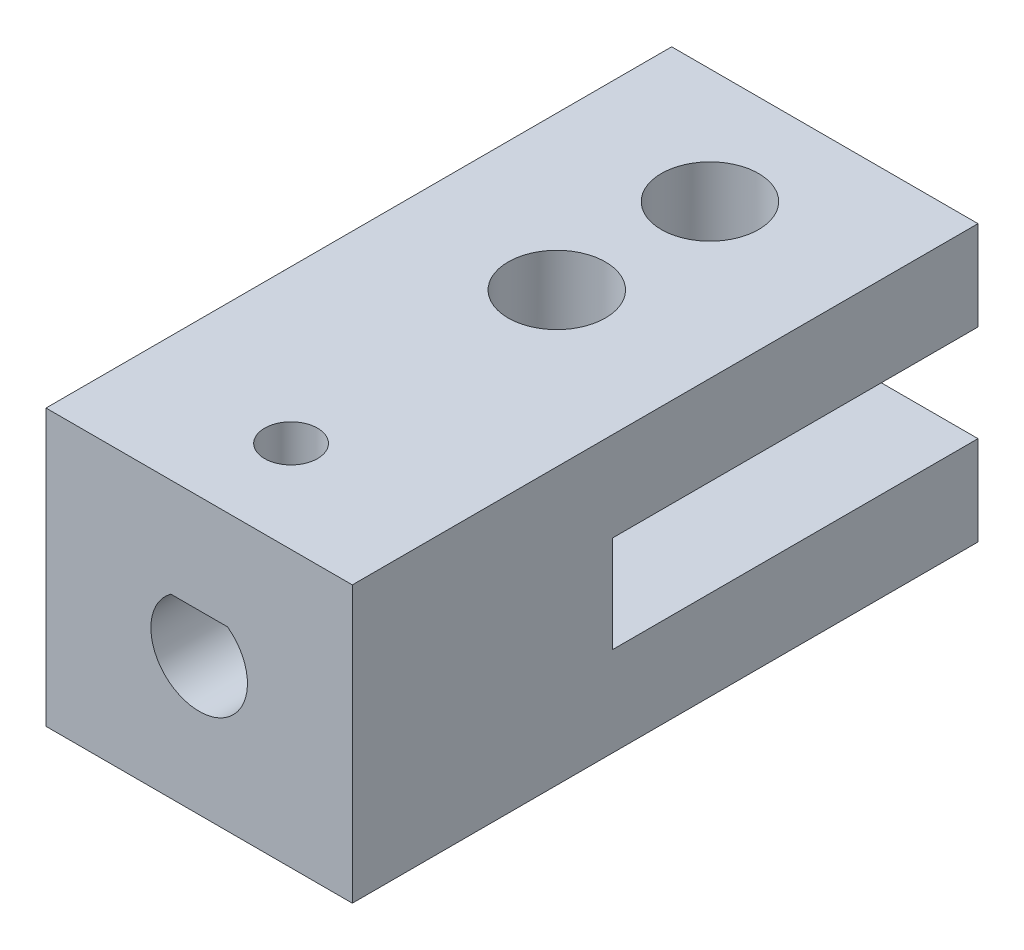
ISO-10303-21;
HEADER;
FILE_DESCRIPTION(('STEP AP214'),'2;1');
FILE_NAME('part.step','',(''),(''),'','','');
FILE_SCHEMA(('AUTOMOTIVE_DESIGN { 1 0 10303 214 1 1 1 1 }'));
ENDSEC;
DATA;
#1=APPLICATION_CONTEXT('core data for automotive mechanical design processes');
#2=APPLICATION_PROTOCOL_DEFINITION('international standard','automotive_design',2000,#1);
#3=PRODUCT_CONTEXT('',#1,'mechanical');
#4=PRODUCT('Part','Part','',(#3));
#5=PRODUCT_RELATED_PRODUCT_CATEGORY('part','',(#4));
#6=PRODUCT_DEFINITION_FORMATION('','',#4);
#7=PRODUCT_DEFINITION_CONTEXT('part definition',#1,'design');
#8=PRODUCT_DEFINITION('design','',#6,#7);
#9=PRODUCT_DEFINITION_SHAPE('','',#8);
#10=(LENGTH_UNIT() NAMED_UNIT(*) SI_UNIT(.MILLI.,.METRE.));
#11=(NAMED_UNIT(*) PLANE_ANGLE_UNIT() SI_UNIT($,.RADIAN.));
#12=(NAMED_UNIT(*) SI_UNIT($,.STERADIAN.) SOLID_ANGLE_UNIT());
#13=UNCERTAINTY_MEASURE_WITH_UNIT(LENGTH_MEASURE(1.E-05),#10,'distance_accuracy_value','');
#14=(GEOMETRIC_REPRESENTATION_CONTEXT(3) GLOBAL_UNCERTAINTY_ASSIGNED_CONTEXT((#13)) GLOBAL_UNIT_ASSIGNED_CONTEXT((#10,
#11,#12)) REPRESENTATION_CONTEXT('',''));
#15=CARTESIAN_POINT('',(0.,0.,0.));
#16=DIRECTION('',(0.,0.,1.));
#17=DIRECTION('',(1.,0.,0.));
#18=AXIS2_PLACEMENT_3D('',#15,#16,#17);
#19=CARTESIAN_POINT('',(-10.,-15.875,73.9879559526874));
#20=DIRECTION('',(-1.,0.,0.));
#21=DIRECTION('',(0.,0.,1.));
#22=AXIS2_PLACEMENT_3D('',#19,#20,#21);
#23=PLANE('',#22);
#24=DIRECTION('',(0.,1.,0.));
#25=VECTOR('',#24,1.);
#26=CARTESIAN_POINT('',(-10.,-15.875,73.9879559526874));
#27=LINE('',#26,#25);
#28=CARTESIAN_POINT('',(-10.,-3.7184,73.9879559526874));
#29=VERTEX_POINT('',#28);
#30=CARTESIAN_POINT('',(-10.,2.12499999999999,73.9879559526874));
#31=VERTEX_POINT('',#30);
#32=EDGE_CURVE('E49',#29,#31,#27,.T.);
#33=ORIENTED_EDGE('',*,*,#32,.F.);
#34=DIRECTION('',(0.,0.,1.));
#35=VECTOR('',#34,1.);
#36=CARTESIAN_POINT('',(-10.,-3.7184,73.9879559526874));
#37=LINE('',#36,#35);
#38=CARTESIAN_POINT('',(-10.,-3.7184,97.8379559526874));
#39=VERTEX_POINT('',#38);
#40=EDGE_CURVE('E106',#29,#39,#37,.T.);
#41=ORIENTED_EDGE('',*,*,#40,.T.);
#42=DIRECTION('',(0.,1.,0.));
#43=VECTOR('',#42,1.);
#44=CARTESIAN_POINT('',(-10.,-9.93,97.8379559526874));
#45=LINE('',#44,#43);
#46=CARTESIAN_POINT('',(-9.99999999999999,-10.0316,97.8379559526874));
#47=VERTEX_POINT('',#46);
#48=EDGE_CURVE('E156',#47,#39,#45,.T.);
#49=ORIENTED_EDGE('',*,*,#48,.F.);
#50=DIRECTION('',(0.,0.,-1.));
#51=VECTOR('',#50,1.);
#52=CARTESIAN_POINT('',(-10.,-10.0316,73.9879559526874));
#53=LINE('',#52,#51);
#54=CARTESIAN_POINT('',(-10.,-10.0316,73.9879559526874));
#55=VERTEX_POINT('',#54);
#56=EDGE_CURVE('E166',#47,#55,#53,.T.);
#57=ORIENTED_EDGE('',*,*,#56,.T.);
#58=CARTESIAN_POINT('',(-10.,-15.875,73.9879559526874));
#59=VERTEX_POINT('',#58);
#60=EDGE_CURVE('E12',#59,#55,#27,.T.);
#61=ORIENTED_EDGE('',*,*,#60,.F.);
#62=DIRECTION('',(0.,0.,1.));
#63=VECTOR('',#62,1.);
#64=CARTESIAN_POINT('',(-10.,-15.875,73.9879559526874));
#65=LINE('',#64,#63);
#66=CARTESIAN_POINT('',(-9.99999999999999,-15.875,114.837955952687));
#67=VERTEX_POINT('',#66);
#68=EDGE_CURVE('E125',#59,#67,#65,.T.);
#69=ORIENTED_EDGE('',*,*,#68,.T.);
#70=DIRECTION('',(0.,1.,0.));
#71=VECTOR('',#70,1.);
#72=CARTESIAN_POINT('',(-9.99999999999999,-15.875,114.837955952687));
#73=LINE('',#72,#71);
#74=CARTESIAN_POINT('',(-9.99999999999999,2.12499999999999,114.837955952687));
#75=VERTEX_POINT('',#74);
#76=EDGE_CURVE('E112',#67,#75,#73,.T.);
#77=ORIENTED_EDGE('',*,*,#76,.T.);
#78=DIRECTION('',(0.,0.,1.));
#79=VECTOR('',#78,1.);
#80=CARTESIAN_POINT('',(-10.,2.12499999999999,73.9879559526874));
#81=LINE('',#80,#79);
#82=EDGE_CURVE('E132',#31,#75,#81,.T.);
#83=ORIENTED_EDGE('',*,*,#82,.F.);
#84=EDGE_LOOP('',(#33,#41,#49,#57,#61,#69,#77,#83));
#85=FACE_BOUND('',#84,.T.);
#86=ADVANCED_FACE('F36',(#85),#23,.T.);
#87=CARTESIAN_POINT('',(-10.,-15.875,73.9879559526874));
#88=DIRECTION('',(0.,0.,-1.));
#89=DIRECTION('',(-1.,0.,0.));
#90=AXIS2_PLACEMENT_3D('',#87,#88,#89);
#91=PLANE('',#90);
#92=ORIENTED_EDGE('',*,*,#60,.T.);
#93=DIRECTION('',(-1.,0.,0.));
#94=VECTOR('',#93,1.);
#95=CARTESIAN_POINT('',(10.1016,-10.0316,73.9879559526874));
#96=LINE('',#95,#94);
#97=CARTESIAN_POINT('',(10.,-10.0316,73.9879559526874));
#98=VERTEX_POINT('',#97);
#99=EDGE_CURVE('E181',#98,#55,#96,.T.);
#100=ORIENTED_EDGE('',*,*,#99,.F.);
#101=DIRECTION('',(0.,1.,0.));
#102=VECTOR('',#101,1.);
#103=CARTESIAN_POINT('',(10.,-15.875,73.9879559526874));
#104=LINE('',#103,#102);
#105=CARTESIAN_POINT('',(10.,-15.875,73.9879559526874));
#106=VERTEX_POINT('',#105);
#107=EDGE_CURVE('E119',#106,#98,#104,.T.);
#108=ORIENTED_EDGE('',*,*,#107,.F.);
#109=DIRECTION('',(-1.,0.,0.));
#110=VECTOR('',#109,1.);
#111=CARTESIAN_POINT('',(-10.,-15.875,73.9879559526874));
#112=LINE('',#111,#110);
#113=EDGE_CURVE('E115',#106,#59,#112,.T.);
#114=ORIENTED_EDGE('',*,*,#113,.T.);
#115=EDGE_LOOP('',(#92,#100,#108,#114));
#116=FACE_BOUND('',#115,.T.);
#117=ADVANCED_FACE('F220',(#116),#91,.T.);
#118=CARTESIAN_POINT('',(10.,-15.875,73.9879559526874));
#119=DIRECTION('',(1.,0.,0.));
#120=DIRECTION('',(0.,0.,-1.));
#121=AXIS2_PLACEMENT_3D('',#118,#119,#120);
#122=PLANE('',#121);
#123=ORIENTED_EDGE('',*,*,#107,.T.);
#124=DIRECTION('',(0.,0.,1.));
#125=VECTOR('',#124,1.);
#126=CARTESIAN_POINT('',(10.,-10.0316,73.9879559526874));
#127=LINE('',#126,#125);
#128=CARTESIAN_POINT('',(10.,-10.0316,97.8379559526874));
#129=VERTEX_POINT('',#128);
#130=EDGE_CURVE('E169',#98,#129,#127,.T.);
#131=ORIENTED_EDGE('',*,*,#130,.T.);
#132=DIRECTION('',(0.,1.,0.));
#133=VECTOR('',#132,1.);
#134=CARTESIAN_POINT('',(10.,-9.93,97.8379559526874));
#135=LINE('',#134,#133);
#136=CARTESIAN_POINT('',(10.,-3.7184,97.8379559526874));
#137=VERTEX_POINT('',#136);
#138=EDGE_CURVE('E94',#129,#137,#135,.T.);
#139=ORIENTED_EDGE('',*,*,#138,.T.);
#140=DIRECTION('',(0.,0.,-1.));
#141=VECTOR('',#140,1.);
#142=CARTESIAN_POINT('',(10.,-3.7184,73.9879559526874));
#143=LINE('',#142,#141);
#144=CARTESIAN_POINT('',(10.,-3.7184,73.9879559526874));
#145=VERTEX_POINT('',#144);
#146=EDGE_CURVE('E176',#137,#145,#143,.T.);
#147=ORIENTED_EDGE('',*,*,#146,.T.);
#148=CARTESIAN_POINT('',(10.,2.12499999999999,73.9879559526874));
#149=VERTEX_POINT('',#148);
#150=EDGE_CURVE('E118',#145,#149,#104,.T.);
#151=ORIENTED_EDGE('',*,*,#150,.T.);
#152=DIRECTION('',(0.,0.,-1.));
#153=VECTOR('',#152,1.);
#154=CARTESIAN_POINT('',(10.,2.12499999999999,73.9879559526874));
#155=LINE('',#154,#153);
#156=CARTESIAN_POINT('',(9.99999999999999,2.12499999999999,114.837955952687));
#157=VERTEX_POINT('',#156);
#158=EDGE_CURVE('E126',#157,#149,#155,.T.);
#159=ORIENTED_EDGE('',*,*,#158,.F.);
#160=DIRECTION('',(0.,1.,0.));
#161=VECTOR('',#160,1.);
#162=CARTESIAN_POINT('',(9.99999999999999,-15.875,114.837955952687));
#163=LINE('',#162,#161);
#164=CARTESIAN_POINT('',(9.99999999999999,-15.875,114.837955952687));
#165=VERTEX_POINT('',#164);
#166=EDGE_CURVE('E114',#165,#157,#163,.T.);
#167=ORIENTED_EDGE('',*,*,#166,.F.);
#168=DIRECTION('',(0.,0.,-1.));
#169=VECTOR('',#168,1.);
#170=CARTESIAN_POINT('',(10.,-15.875,73.9879559526874));
#171=LINE('',#170,#169);
#172=EDGE_CURVE('E138',#165,#106,#171,.T.);
#173=ORIENTED_EDGE('',*,*,#172,.T.);
#174=EDGE_LOOP('',(#123,#131,#139,#147,#151,#159,#167,#173));
#175=FACE_BOUND('',#174,.T.);
#176=ADVANCED_FACE('F211',(#175),#122,.T.);
#177=CARTESIAN_POINT('',(0.,-15.875,91.4879559526874));
#178=DIRECTION('',(0.,1.,0.));
#179=DIRECTION('',(0.,0.,1.));
#180=AXIS2_PLACEMENT_3D('',#177,#178,#179);
#181=CYLINDRICAL_SURFACE('',#180,3.175);
#182=CARTESIAN_POINT('',(0.,-15.875,91.4879559526874));
#183=DIRECTION('',(0.,1.,0.));
#184=DIRECTION('',(0.,0.,1.));
#185=AXIS2_PLACEMENT_3D('',#182,#183,#184);
#186=CIRCLE('',#185,3.175);
#187=CARTESIAN_POINT('',(0.,-15.875,94.6629559526874));
#188=VERTEX_POINT('',#187);
#189=EDGE_CURVE('E135',#188,#188,#186,.T.);
#190=ORIENTED_EDGE('',*,*,#189,.F.);
#191=EDGE_LOOP('',(#190));
#192=FACE_BOUND('',#191,.T.);
#193=CARTESIAN_POINT('',(0.,-10.0316,91.4879559526874));
#194=DIRECTION('',(0.,1.,0.));
#195=DIRECTION('',(0.,0.,1.));
#196=AXIS2_PLACEMENT_3D('',#193,#194,#195);
#197=CIRCLE('',#196,3.175);
#198=CARTESIAN_POINT('',(0.,-10.0316,94.6629559526874));
#199=VERTEX_POINT('',#198);
#200=EDGE_CURVE('E105',#199,#199,#197,.F.);
#201=ORIENTED_EDGE('',*,*,#200,.F.);
#202=EDGE_LOOP('',(#201));
#203=FACE_BOUND('',#202,.T.);
#204=ADVANCED_FACE('F312',(#192,#203),#181,.F.);
#205=CARTESIAN_POINT('',(0.,-15.875,81.4879559526874));
#206=DIRECTION('',(0.,1.,0.));
#207=DIRECTION('',(0.,0.,1.));
#208=AXIS2_PLACEMENT_3D('',#205,#206,#207);
#209=CYLINDRICAL_SURFACE('',#208,3.175);
#210=CARTESIAN_POINT('',(0.,-15.875,81.4879559526874));
#211=DIRECTION('',(0.,1.,0.));
#212=DIRECTION('',(0.,0.,1.));
#213=AXIS2_PLACEMENT_3D('',#210,#211,#212);
#214=CIRCLE('',#213,3.175);
#215=CARTESIAN_POINT('',(0.,-15.875,84.6629559526874));
#216=VERTEX_POINT('',#215);
#217=EDGE_CURVE('E149',#216,#216,#214,.T.);
#218=ORIENTED_EDGE('',*,*,#217,.F.);
#219=EDGE_LOOP('',(#218));
#220=FACE_BOUND('',#219,.T.);
#221=CARTESIAN_POINT('',(0.,-10.0316,81.4879559526874));
#222=DIRECTION('',(0.,1.,0.));
#223=DIRECTION('',(0.,0.,1.));
#224=AXIS2_PLACEMENT_3D('',#221,#222,#223);
#225=CIRCLE('',#224,3.175);
#226=CARTESIAN_POINT('',(0.,-10.0316,84.6629559526874));
#227=VERTEX_POINT('',#226);
#228=EDGE_CURVE('E102',#227,#227,#225,.F.);
#229=ORIENTED_EDGE('',*,*,#228,.F.);
#230=EDGE_LOOP('',(#229));
#231=FACE_BOUND('',#230,.T.);
#232=ADVANCED_FACE('F272',(#220,#231),#209,.F.);
#233=ORIENTED_EDGE('',*,*,#150,.F.);
#234=DIRECTION('',(1.,0.,0.));
#235=VECTOR('',#234,1.);
#236=CARTESIAN_POINT('',(-10.1016,-3.7184,73.9879559526874));
#237=LINE('',#236,#235);
#238=EDGE_CURVE('E111',#29,#145,#237,.T.);
#239=ORIENTED_EDGE('',*,*,#238,.F.);
#240=ORIENTED_EDGE('',*,*,#32,.T.);
#241=DIRECTION('',(-1.,0.,0.));
#242=VECTOR('',#241,1.);
#243=CARTESIAN_POINT('',(-10.,2.12499999999999,73.9879559526874));
#244=LINE('',#243,#242);
#245=EDGE_CURVE('E122',#149,#31,#244,.T.);
#246=ORIENTED_EDGE('',*,*,#245,.F.);
#247=EDGE_LOOP('',(#233,#239,#240,#246));
#248=FACE_BOUND('',#247,.T.);
#249=ADVANCED_FACE('F253',(#248),#91,.T.);
#250=CARTESIAN_POINT('',(0.,2.12499999999999,91.4879559526874));
#251=DIRECTION('',(0.,1.,0.));
#252=DIRECTION('',(0.,0.,1.));
#253=AXIS2_PLACEMENT_3D('',#250,#251,#252);
#254=CIRCLE('',#253,3.175);
#255=CARTESIAN_POINT('',(0.,2.12499999999999,94.6629559526874));
#256=VERTEX_POINT('',#255);
#257=EDGE_CURVE('E146',#256,#256,#254,.T.);
#258=ORIENTED_EDGE('',*,*,#257,.T.);
#259=EDGE_LOOP('',(#258));
#260=FACE_BOUND('',#259,.T.);
#261=CARTESIAN_POINT('',(0.,-3.7184,91.4879559526874));
#262=DIRECTION('',(0.,-1.,0.));
#263=DIRECTION('',(0.,0.,-1.));
#264=AXIS2_PLACEMENT_3D('',#261,#262,#263);
#265=CIRCLE('',#264,3.175);
#266=CARTESIAN_POINT('',(0.,-3.7184,88.3129559526874));
#267=VERTEX_POINT('',#266);
#268=EDGE_CURVE('E110',#267,#267,#265,.F.);
#269=ORIENTED_EDGE('',*,*,#268,.F.);
#270=EDGE_LOOP('',(#269));
#271=FACE_BOUND('',#270,.T.);
#272=ADVANCED_FACE('F269',(#260,#271),#181,.F.);
#273=CARTESIAN_POINT('',(0.,2.12499999999999,81.4879559526874));
#274=DIRECTION('',(0.,1.,0.));
#275=DIRECTION('',(0.,0.,1.));
#276=AXIS2_PLACEMENT_3D('',#273,#274,#275);
#277=CIRCLE('',#276,3.175);
#278=CARTESIAN_POINT('',(0.,2.12499999999999,84.6629559526874));
#279=VERTEX_POINT('',#278);
#280=EDGE_CURVE('E101',#279,#279,#277,.T.);
#281=ORIENTED_EDGE('',*,*,#280,.T.);
#282=EDGE_LOOP('',(#281));
#283=FACE_BOUND('',#282,.T.);
#284=CARTESIAN_POINT('',(0.,-3.7184,81.4879559526874));
#285=DIRECTION('',(0.,-1.,0.));
#286=DIRECTION('',(0.,0.,-1.));
#287=AXIS2_PLACEMENT_3D('',#284,#285,#286);
#288=CIRCLE('',#287,3.175);
#289=CARTESIAN_POINT('',(0.,-3.7184,78.3129559526874));
#290=VERTEX_POINT('',#289);
#291=EDGE_CURVE('E107',#290,#290,#288,.F.);
#292=ORIENTED_EDGE('',*,*,#291,.F.);
#293=EDGE_LOOP('',(#292));
#294=FACE_BOUND('',#293,.T.);
#295=ADVANCED_FACE('F260',(#283,#294),#209,.F.);
#296=CARTESIAN_POINT('',(-9.99999999999999,-15.875,114.837955952687));
#297=DIRECTION('',(0.,0.,1.));
#298=DIRECTION('',(1.,0.,0.));
#299=AXIS2_PLACEMENT_3D('',#296,#297,#298);
#300=PLANE('',#299);
#301=CARTESIAN_POINT('',(-4.54497550705923E-13,-6.875,114.837955952687));
#302=DIRECTION('',(0.,0.,1.));
#303=DIRECTION('',(1.,0.,0.));
#304=AXIS2_PLACEMENT_3D('',#301,#302,#303);
#305=CIRCLE('',#304,3.15239999999999);
#306=CARTESIAN_POINT('',(-1.85010269985253,-4.3226,114.837955952687));
#307=VERTEX_POINT('',#306);
#308=CARTESIAN_POINT('',(1.85010269985162,-4.3226,114.837955952687));
#309=VERTEX_POINT('',#308);
#310=EDGE_CURVE('E58',#307,#309,#305,.T.);
#311=ORIENTED_EDGE('',*,*,#310,.F.);
#312=DIRECTION('',(-1.,0.,0.));
#313=VECTOR('',#312,1.);
#314=CARTESIAN_POINT('',(-9.99999999999999,-4.3226,114.837955952687));
#315=LINE('',#314,#313);
#316=EDGE_CURVE('E90',#309,#307,#315,.T.);
#317=ORIENTED_EDGE('',*,*,#316,.F.);
#318=EDGE_LOOP('',(#311,#317));
#319=FACE_BOUND('',#318,.T.);
#320=DIRECTION('',(1.,0.,0.));
#321=VECTOR('',#320,1.);
#322=CARTESIAN_POINT('',(-9.99999999999999,2.12499999999999,114.837955952687));
#323=LINE('',#322,#321);
#324=EDGE_CURVE('E129',#75,#157,#323,.T.);
#325=ORIENTED_EDGE('',*,*,#324,.F.);
#326=ORIENTED_EDGE('',*,*,#76,.F.);
#327=DIRECTION('',(1.,0.,0.));
#328=VECTOR('',#327,1.);
#329=CARTESIAN_POINT('',(-9.99999999999999,-15.875,114.837955952687));
#330=LINE('',#329,#328);
#331=EDGE_CURVE('E141',#67,#165,#330,.T.);
#332=ORIENTED_EDGE('',*,*,#331,.T.);
#333=ORIENTED_EDGE('',*,*,#166,.T.);
#334=EDGE_LOOP('',(#325,#326,#332,#333));
#335=FACE_BOUND('',#334,.T.);
#336=ADVANCED_FACE('F258',(#319,#335),#300,.T.);
#337=CARTESIAN_POINT('',(0.,-15.875,0.));
#338=DIRECTION('',(0.,1.,0.));
#339=DIRECTION('',(0.,0.,1.));
#340=AXIS2_PLACEMENT_3D('',#337,#338,#339);
#341=PLANE('',#340);
#342=CARTESIAN_POINT('',(-4.55410697351461E-13,-15.875,108.837955952687));
#343=DIRECTION('',(0.,1.,0.));
#344=DIRECTION('',(0.,0.,1.));
#345=AXIS2_PLACEMENT_3D('',#342,#343,#344);
#346=CIRCLE('',#345,1.7272);
#347=CARTESIAN_POINT('',(-4.55410697351461E-13,-15.875,110.565155952687));
#348=VERTEX_POINT('',#347);
#349=EDGE_CURVE('E98',#348,#348,#346,.T.);
#350=ORIENTED_EDGE('',*,*,#349,.T.);
#351=EDGE_LOOP('',(#350));
#352=FACE_BOUND('',#351,.T.);
#353=ORIENTED_EDGE('',*,*,#217,.T.);
#354=EDGE_LOOP('',(#353));
#355=FACE_BOUND('',#354,.T.);
#356=ORIENTED_EDGE('',*,*,#189,.T.);
#357=EDGE_LOOP('',(#356));
#358=FACE_BOUND('',#357,.T.);
#359=ORIENTED_EDGE('',*,*,#68,.F.);
#360=ORIENTED_EDGE('',*,*,#113,.F.);
#361=ORIENTED_EDGE('',*,*,#172,.F.);
#362=ORIENTED_EDGE('',*,*,#331,.F.);
#363=EDGE_LOOP('',(#359,#360,#361,#362));
#364=FACE_BOUND('',#363,.T.);
#365=ADVANCED_FACE('F257',(#352,#355,#358,#364),#341,.F.);
#366=CARTESIAN_POINT('',(0.,2.12499999999999,0.));
#367=DIRECTION('',(0.,1.,0.));
#368=DIRECTION('',(0.,0.,1.));
#369=AXIS2_PLACEMENT_3D('',#366,#367,#368);
#370=PLANE('',#369);
#371=CARTESIAN_POINT('',(-4.55410697351461E-13,2.12499999999999,108.837955952687));
#372=DIRECTION('',(0.,1.,0.));
#373=DIRECTION('',(0.,0.,1.));
#374=AXIS2_PLACEMENT_3D('',#371,#372,#373);
#375=CIRCLE('',#374,1.7272);
#376=CARTESIAN_POINT('',(-4.55410697351461E-13,2.12499999999999,110.565155952687));
#377=VERTEX_POINT('',#376);
#378=EDGE_CURVE('E163',#377,#377,#375,.T.);
#379=ORIENTED_EDGE('',*,*,#378,.F.);
#380=EDGE_LOOP('',(#379));
#381=FACE_BOUND('',#380,.T.);
#382=ORIENTED_EDGE('',*,*,#280,.F.);
#383=EDGE_LOOP('',(#382));
#384=FACE_BOUND('',#383,.T.);
#385=ORIENTED_EDGE('',*,*,#257,.F.);
#386=EDGE_LOOP('',(#385));
#387=FACE_BOUND('',#386,.T.);
#388=ORIENTED_EDGE('',*,*,#82,.T.);
#389=ORIENTED_EDGE('',*,*,#324,.T.);
#390=ORIENTED_EDGE('',*,*,#158,.T.);
#391=ORIENTED_EDGE('',*,*,#245,.T.);
#392=EDGE_LOOP('',(#388,#389,#390,#391));
#393=FACE_BOUND('',#392,.T.);
#394=ADVANCED_FACE('F255',(#381,#384,#387,#393),#370,.T.);
#395=CARTESIAN_POINT('',(-4.54497550705923E-13,-6.875,102.837955952687));
#396=DIRECTION('',(0.,0.,1.));
#397=DIRECTION('',(1.,0.,0.));
#398=AXIS2_PLACEMENT_3D('',#395,#396,#397);
#399=CYLINDRICAL_SURFACE('',#398,3.15239999999999);
#400=CARTESIAN_POINT('',(-0.00794861585216269,-10.0273899789693,107.110774242645));
#401=CARTESIAN_POINT('',(0.0816681273310027,-10.0276108571251,107.110367462638));
#402=CARTESIAN_POINT('',(0.171399956381705,-10.0239818515383,107.11696399348));
#403=CARTESIAN_POINT('',(0.348228870194593,-10.0093682897954,107.143854164881));
#404=CARTESIAN_POINT('',(0.435322196935814,-9.9983737143487,107.164166463121));
#405=CARTESIAN_POINT('',(0.604057925827596,-9.97016245518381,107.217421773619));
#406=CARTESIAN_POINT('',(0.685720871177772,-9.95297101243027,107.250313579944));
#407=CARTESIAN_POINT('',(0.842202139753427,-9.91388719369847,107.327481053053));
#408=CARTESIAN_POINT('',(0.91702016655355,-9.89199461427054,107.37175721253));
#409=CARTESIAN_POINT('',(1.06338083310328,-9.84370002208313,107.473796855781));
#410=CARTESIAN_POINT('',(1.13436003329298,-9.81709320123703,107.53226982013));
#411=CARTESIAN_POINT('',(1.26604586785008,-9.76287717325851,107.659506242039));
#412=CARTESIAN_POINT('',(1.32674308046544,-9.73526707461765,107.728279030153));
#413=CARTESIAN_POINT('',(1.4422239352438,-9.67895051867904,107.882255664794));
#414=CARTESIAN_POINT('',(1.49582712636457,-9.65040615628205,107.968412161925));
#415=CARTESIAN_POINT('',(1.58760138817949,-9.5989548622577,108.150146866448));
#416=CARTESIAN_POINT('',(1.62578368400738,-9.57604383479914,108.245718157386));
#417=CARTESIAN_POINT('',(1.68304236850709,-9.54072198540376,108.437929022568));
#418=CARTESIAN_POINT('',(1.70312562851452,-9.52776471251951,108.534162190181));
#419=CARTESIAN_POINT('',(1.72657764344517,-9.51256972278209,108.729421061357));
#420=CARTESIAN_POINT('',(1.72997077999812,-9.51031636936126,108.828442478764));
#421=CARTESIAN_POINT('',(1.72062452747472,-9.51641602044114,109.01021490578));
#422=CARTESIAN_POINT('',(1.71025386571989,-9.52321221916559,109.093155814853));
#423=CARTESIAN_POINT('',(1.6779345869595,-9.54380593614793,109.255852198748));
#424=CARTESIAN_POINT('',(1.6559807759612,-9.55760659516581,109.335606227271));
#425=CARTESIAN_POINT('',(1.60093676406198,-9.59081828188451,109.491552804097));
#426=CARTESIAN_POINT('',(1.56765398353127,-9.61032544799814,109.567655878936));
#427=CARTESIAN_POINT('',(1.49107479586263,-9.65281170737896,109.713577682662));
#428=CARTESIAN_POINT('',(1.44777415277365,-9.67579226790641,109.783393735749));
#429=CARTESIAN_POINT('',(1.34454452099434,-9.72695282578262,109.926233517313));
#430=CARTESIAN_POINT('',(1.28307514737265,-9.75538459972795,109.998057839901));
#431=CARTESIAN_POINT('',(1.14904234997896,-9.8114278894645,110.130950852382));
#432=CARTESIAN_POINT('',(1.07647134049734,-9.83903882885731,110.19201212605));
#433=CARTESIAN_POINT('',(0.916081188674691,-9.89262212541476,110.305717545833));
#434=CARTESIAN_POINT('',(0.827555503411714,-9.91835003516243,110.357490415168));
#435=CARTESIAN_POINT('',(0.641313514816914,-9.96295707689711,110.444969620671));
#436=CARTESIAN_POINT('',(0.5436057091157,-9.98184246422914,110.48069063845));
#437=CARTESIAN_POINT('',(0.351262871862725,-10.0091348775233,110.531713330342));
#438=CARTESIAN_POINT('',(0.257157366289546,-10.0183390588791,110.548577387448));
#439=CARTESIAN_POINT('',(0.0670296232527753,-10.0281207292829,110.566488800053));
#440=CARTESIAN_POINT('',(-0.0289913262824548,-10.0287038314794,110.567546447044));
#441=CARTESIAN_POINT('',(-0.210127480670771,-10.0215666649589,110.554491776176));
#442=CARTESIAN_POINT('',(-0.295387465098218,-10.0146563819711,110.541859347492));
#443=CARTESIAN_POINT('',(-0.462356513010789,-9.99444316224241,110.504320117591));
#444=CARTESIAN_POINT('',(-0.544065231656632,-9.98113960619983,110.479412127263));
#445=CARTESIAN_POINT('',(-0.703656701763692,-9.94896525309182,110.417690957932));
#446=CARTESIAN_POINT('',(-0.78142562188745,-9.92998517750569,110.380642584275));
#447=CARTESIAN_POINT('',(-0.929839052197995,-9.88813448693962,110.296011326158));
#448=CARTESIAN_POINT('',(-1.00048098692657,-9.86526247350579,110.248424653211));
#449=CARTESIAN_POINT('',(-1.14097553287724,-9.81472301227703,110.138046488048));
#450=CARTESIAN_POINT('',(-1.20987424175924,-9.78680500859425,110.074154733251));
#451=CARTESIAN_POINT('',(-1.33649795337001,-9.73090612487136,109.936038222994));
#452=CARTESIAN_POINT('',(-1.39421143079029,-9.7029252097144,109.861802943449));
#453=CARTESIAN_POINT('',(-1.50127476563062,-9.64767148229671,109.698012578178));
#454=CARTESIAN_POINT('',(-1.54961474195321,-9.62062600604452,109.60771283096));
#455=CARTESIAN_POINT('',(-1.6299736832524,-9.5737031924034,109.418420129029));
#456=CARTESIAN_POINT('',(-1.66201553416204,-9.55381581511108,109.319439594353));
#457=CARTESIAN_POINT('',(-1.70573783952331,-9.52616958782438,109.125377120129));
#458=CARTESIAN_POINT('',(-1.71905301581709,-9.51744411526989,109.030807287173));
#459=CARTESIAN_POINT('',(-1.72982116438268,-9.51041244835459,108.840415355788));
#460=CARTESIAN_POINT('',(-1.72728818543949,-9.51209702586524,108.74459444158));
#461=CARTESIAN_POINT('',(-1.70801486665489,-9.52460386231561,108.568367041547));
#462=CARTESIAN_POINT('',(-1.69325582124874,-9.53415079350195,108.487638102933));
#463=CARTESIAN_POINT('',(-1.65282043691539,-9.55946939433558,108.329988863286));
#464=CARTESIAN_POINT('',(-1.62713961463156,-9.57524362007759,108.25307014083));
#465=CARTESIAN_POINT('',(-1.56400369650315,-9.61232116572664,108.100152715517));
#466=CARTESIAN_POINT('',(-1.52594964830126,-9.63389313228023,108.024468861186));
#467=CARTESIAN_POINT('',(-1.43970247519044,-9.67986553629119,107.880063115941));
#468=CARTESIAN_POINT('',(-1.39150407653952,-9.70426744197438,107.811344873877));
#469=CARTESIAN_POINT('',(-1.27759510569349,-9.75769311393275,107.671633390877));
#470=CARTESIAN_POINT('',(-1.21032621647896,-9.78684479710179,107.601952757788));
#471=CARTESIAN_POINT('',(-1.06458304744122,-9.84323095746524,107.474407801453));
#472=CARTESIAN_POINT('',(-0.986100633874601,-9.87046402138946,107.416552130148));
#473=CARTESIAN_POINT('',(-0.816345337425346,-9.92119976601135,107.312483404969));
#474=CARTESIAN_POINT('',(-0.724710450793453,-9.94453024131869,107.26677173322));
#475=CARTESIAN_POINT('',(-0.533469171123154,-9.98345384691053,107.192019772715));
#476=CARTESIAN_POINT('',(-0.433884006211647,-9.99906683086233,107.162936675484));
#477=CARTESIAN_POINT('',(-0.278920957727993,-10.0154962212997,107.132559553455));
#478=CARTESIAN_POINT('',(-0.225132271485318,-10.0198181528262,107.124627377478));
#479=CARTESIAN_POINT('',(-0.116892775424806,-10.0256978631586,107.113858422894));
#480=CARTESIAN_POINT('',(-0.0624419721685462,-10.0272556693345,107.111021593832));
#481=CARTESIAN_POINT('',(-0.00794861585216269,-10.0273899789693,107.110774242645));
#482=B_SPLINE_CURVE_WITH_KNOTS('',3,(#400,#401,#402,#403,#404,#405,#406,#407,#408,#409,#410,
#411,#412,#413,#414,#415,#416,#417,#418,#419,#420,#421,#422,#423,#424,#425,#426,#427,#428,#429,
#430,#431,#432,#433,#434,#435,#436,#437,#438,#439,#440,#441,#442,#443,#444,#445,#446,#447,#448,
#449,#450,#451,#452,#453,#454,#455,#456,#457,#458,#459,#460,#461,#462,#463,#464,#465,#466,#467,
#468,#469,#470,#471,#472,#473,#474,#475,#476,#477,#478,#479,#480,#481),.UNSPECIFIED.,.T.,.F.,(4,
2,2,2,2,2,2,2,2,2,2,2,2,2,2,2,2,2,2,2,2,2,2,2,2,2,2,2,2,2,2,2,2,2,2,2,2,2,2,2,4),(0.,
0.268634819307419,0.537635803126478,0.805553254053855,1.07348230190093,1.35952581368014,
1.64583003587444,1.96048019918112,2.27490090864344,2.57050023686622,2.86566761272665,
3.11606769228065,3.36658014912403,3.62158337394934,3.87669462199605,4.17161365810826,
4.46673511900098,4.78221614533396,5.09740803094415,5.38391681029533,5.67023903676015,
5.92843680871768,6.18665959674486,6.45021406416973,6.71386343292393,7.00671231728312,
7.29986136846131,7.6159837745776,7.93166104555299,8.21757934143206,8.50324421758175,
8.75001565079396,8.99688848086348,9.25814833149786,9.51954434022714,9.82165233337759,
10.1239805840105,10.4373313971488,10.7498718475155,10.9132225491984,11.0765716333934),.UNSPECIFIED.);
#483=CARTESIAN_POINT('',(-0.00794861585216269,-10.0273899789693,107.110774242645));
#484=VERTEX_POINT('',#483);
#485=EDGE_CURVE('E40',#484,#484,#482,.T.);
#486=ORIENTED_EDGE('',*,*,#485,.T.);
#487=EDGE_LOOP('',(#486));
#488=FACE_BOUND('',#487,.T.);
#489=ORIENTED_EDGE('',*,*,#310,.T.);
#490=DIRECTION('',(0.,0.,1.));
#491=VECTOR('',#490,1.);
#492=CARTESIAN_POINT('',(1.85010269985162,-4.3226,102.837955952687));
#493=LINE('',#492,#491);
#494=CARTESIAN_POINT('',(1.85010269985162,-4.3226,102.837955952687));
#495=VERTEX_POINT('',#494);
#496=EDGE_CURVE('E80',#495,#309,#493,.T.);
#497=ORIENTED_EDGE('',*,*,#496,.F.);
#498=CARTESIAN_POINT('',(-4.54497550705923E-13,-6.875,102.837955952687));
#499=DIRECTION('',(0.,0.,1.));
#500=DIRECTION('',(1.,0.,0.));
#501=AXIS2_PLACEMENT_3D('',#498,#499,#500);
#502=CIRCLE('',#501,3.15239999999999);
#503=CARTESIAN_POINT('',(-1.85010269985253,-4.3226,102.837955952687));
#504=VERTEX_POINT('',#503);
#505=EDGE_CURVE('E83',#504,#495,#502,.T.);
#506=ORIENTED_EDGE('',*,*,#505,.F.);
#507=DIRECTION('',(0.,0.,1.));
#508=VECTOR('',#507,1.);
#509=CARTESIAN_POINT('',(-1.85010269985253,-4.3226,102.837955952687));
#510=LINE('',#509,#508);
#511=EDGE_CURVE('E75',#504,#307,#510,.T.);
#512=ORIENTED_EDGE('',*,*,#511,.T.);
#513=EDGE_LOOP('',(#489,#497,#506,#512));
#514=FACE_BOUND('',#513,.T.);
#515=ADVANCED_FACE('F82',(#488,#514),#399,.F.);
#516=CARTESIAN_POINT('',(-1.80000000000044,-4.3226,102.837955952687));
#517=DIRECTION('',(0.,1.,0.));
#518=DIRECTION('',(-1.,0.,0.));
#519=AXIS2_PLACEMENT_3D('',#516,#517,#518);
#520=PLANE('',#519);
#521=CARTESIAN_POINT('',(-4.55410697351461E-13,-4.3226,108.837955952687));
#522=DIRECTION('',(0.,1.,0.));
#523=DIRECTION('',(-1.,0.,0.));
#524=AXIS2_PLACEMENT_3D('',#521,#522,#523);
#525=CIRCLE('',#524,1.7272);
#526=CARTESIAN_POINT('',(-1.72720000000045,-4.3226,108.837955952687));
#527=VERTEX_POINT('',#526);
#528=EDGE_CURVE('E96',#527,#527,#525,.T.);
#529=ORIENTED_EDGE('',*,*,#528,.T.);
#530=EDGE_LOOP('',(#529));
#531=FACE_BOUND('',#530,.T.);
#532=ORIENTED_EDGE('',*,*,#316,.T.);
#533=ORIENTED_EDGE('',*,*,#511,.F.);
#534=DIRECTION('',(-1.,0.,0.));
#535=VECTOR('',#534,1.);
#536=CARTESIAN_POINT('',(-4.5388259123369E-13,-4.3226,102.837955952687));
#537=LINE('',#536,#535);
#538=EDGE_CURVE('E86',#495,#504,#537,.T.);
#539=ORIENTED_EDGE('',*,*,#538,.F.);
#540=ORIENTED_EDGE('',*,*,#496,.T.);
#541=EDGE_LOOP('',(#532,#533,#539,#540));
#542=FACE_BOUND('',#541,.T.);
#543=ADVANCED_FACE('F38',(#531,#542),#520,.F.);
#544=CARTESIAN_POINT('',(-4.54497550705923E-13,-6.875,102.837955952687));
#545=DIRECTION('',(0.,0.,1.));
#546=DIRECTION('',(1.,0.,0.));
#547=AXIS2_PLACEMENT_3D('',#544,#545,#546);
#548=PLANE('',#547);
#549=ORIENTED_EDGE('',*,*,#505,.T.);
#550=ORIENTED_EDGE('',*,*,#538,.T.);
#551=EDGE_LOOP('',(#549,#550));
#552=FACE_BOUND('',#551,.T.);
#553=ADVANCED_FACE('F89',(#552),#548,.T.);
#554=CARTESIAN_POINT('',(-10.,-9.93,97.8379559526874));
#555=DIRECTION('',(0.,0.,1.));
#556=DIRECTION('',(1.,0.,0.));
#557=AXIS2_PLACEMENT_3D('',#554,#555,#556);
#558=PLANE('',#557);
#559=ORIENTED_EDGE('',*,*,#48,.T.);
#560=DIRECTION('',(1.,0.,0.));
#561=VECTOR('',#560,1.);
#562=CARTESIAN_POINT('',(-10.1016,-3.7184,97.8379559526874));
#563=LINE('',#562,#561);
#564=EDGE_CURVE('E187',#39,#137,#563,.T.);
#565=ORIENTED_EDGE('',*,*,#564,.T.);
#566=ORIENTED_EDGE('',*,*,#138,.F.);
#567=DIRECTION('',(-1.,0.,0.));
#568=VECTOR('',#567,1.);
#569=CARTESIAN_POINT('',(10.1016,-10.0316,97.8379559526874));
#570=LINE('',#569,#568);
#571=EDGE_CURVE('E184',#129,#47,#570,.T.);
#572=ORIENTED_EDGE('',*,*,#571,.T.);
#573=EDGE_LOOP('',(#559,#565,#566,#572));
#574=FACE_BOUND('',#573,.T.);
#575=ADVANCED_FACE('F195',(#574),#558,.F.);
#576=CARTESIAN_POINT('',(-4.55410697351461E-13,2.12499999999999,108.837955952687));
#577=DIRECTION('',(0.,1.,0.));
#578=DIRECTION('',(0.,0.,1.));
#579=AXIS2_PLACEMENT_3D('',#576,#577,#578);
#580=CYLINDRICAL_SURFACE('',#579,1.7272);
#581=ORIENTED_EDGE('',*,*,#378,.T.);
#582=EDGE_LOOP('',(#581));
#583=FACE_BOUND('',#582,.T.);
#584=ORIENTED_EDGE('',*,*,#528,.F.);
#585=EDGE_LOOP('',(#584));
#586=FACE_BOUND('',#585,.T.);
#587=ADVANCED_FACE('F295',(#583,#586),#580,.F.);
#588=ORIENTED_EDGE('',*,*,#349,.F.);
#589=EDGE_LOOP('',(#588));
#590=FACE_BOUND('',#589,.T.);
#591=ORIENTED_EDGE('',*,*,#485,.F.);
#592=EDGE_LOOP('',(#591));
#593=FACE_BOUND('',#592,.T.);
#594=ADVANCED_FACE('F293',(#590,#593),#580,.F.);
#595=CARTESIAN_POINT('',(-10.1016,-3.7184,52.8213363718474));
#596=DIRECTION('',(0.,-1.,0.));
#597=DIRECTION('',(0.,0.,-1.));
#598=AXIS2_PLACEMENT_3D('',#595,#596,#597);
#599=PLANE('',#598);
#600=ORIENTED_EDGE('',*,*,#238,.T.);
#601=ORIENTED_EDGE('',*,*,#146,.F.);
#602=ORIENTED_EDGE('',*,*,#564,.F.);
#603=ORIENTED_EDGE('',*,*,#40,.F.);
#604=EDGE_LOOP('',(#600,#601,#602,#603));
#605=FACE_BOUND('',#604,.T.);
#606=ORIENTED_EDGE('',*,*,#291,.T.);
#607=EDGE_LOOP('',(#606));
#608=FACE_BOUND('',#607,.T.);
#609=ORIENTED_EDGE('',*,*,#268,.T.);
#610=EDGE_LOOP('',(#609));
#611=FACE_BOUND('',#610,.T.);
#612=ADVANCED_FACE('F251',(#605,#608,#611),#599,.T.);
#613=CARTESIAN_POINT('',(10.1016,-10.0316,52.8213363718474));
#614=DIRECTION('',(0.,1.,0.));
#615=DIRECTION('',(0.,0.,1.));
#616=AXIS2_PLACEMENT_3D('',#613,#614,#615);
#617=PLANE('',#616);
#618=ORIENTED_EDGE('',*,*,#571,.F.);
#619=ORIENTED_EDGE('',*,*,#130,.F.);
#620=ORIENTED_EDGE('',*,*,#99,.T.);
#621=ORIENTED_EDGE('',*,*,#56,.F.);
#622=EDGE_LOOP('',(#618,#619,#620,#621));
#623=FACE_BOUND('',#622,.T.);
#624=ORIENTED_EDGE('',*,*,#228,.T.);
#625=EDGE_LOOP('',(#624));
#626=FACE_BOUND('',#625,.T.);
#627=ORIENTED_EDGE('',*,*,#200,.T.);
#628=EDGE_LOOP('',(#627));
#629=FACE_BOUND('',#628,.T.);
#630=ADVANCED_FACE('F204',(#623,#626,#629),#617,.T.);
#631=CLOSED_SHELL('',(#86,#117,#176,#204,#232,#249,#272,#295,#336,#365,#394,#515,#543,#553,#575,
#587,#594,#612,#630));
#632=MANIFOLD_SOLID_BREP('B2',#631);
#633=ADVANCED_BREP_SHAPE_REPRESENTATION('',(#18,#632),#14);
#634=SHAPE_DEFINITION_REPRESENTATION(#9,#633);
ENDSEC;
END-ISO-10303-21;
